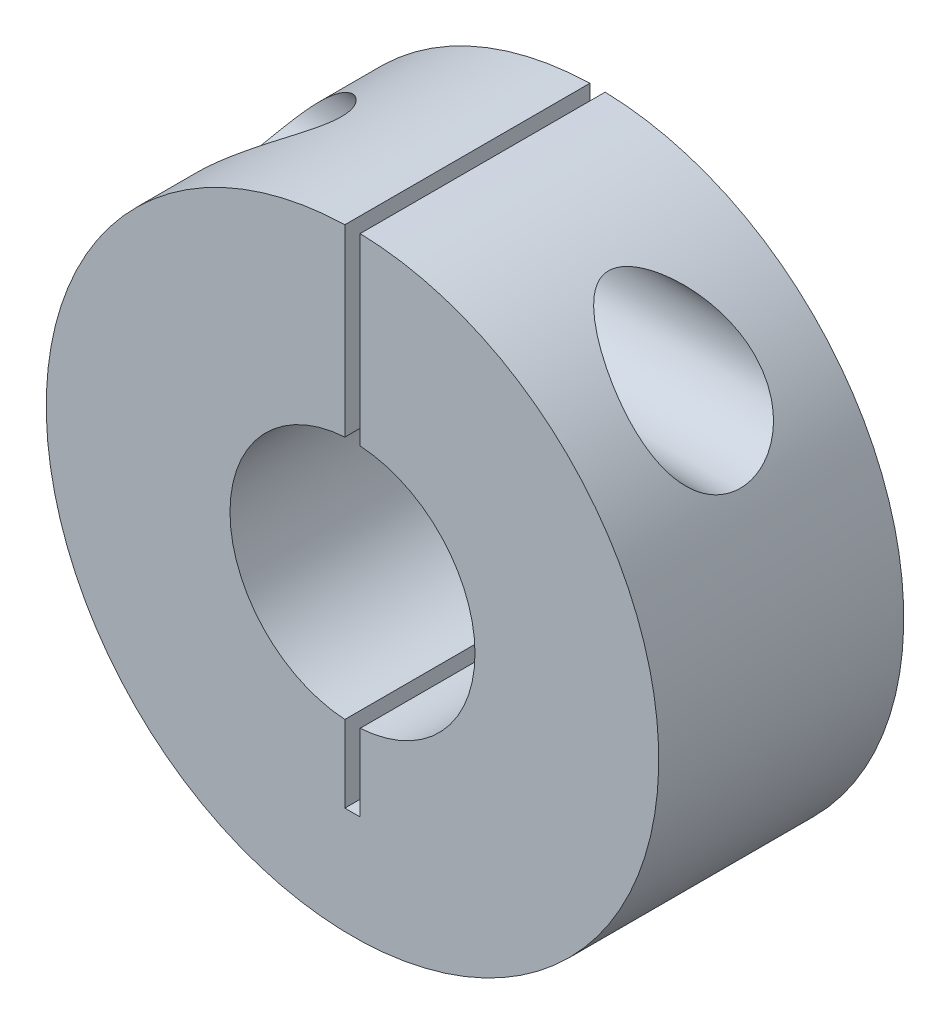
ISO-10303-21;
HEADER;
FILE_DESCRIPTION(('STEP AP214'),'2;1');
FILE_NAME('part.step','',(''),(''),'','','');
FILE_SCHEMA(('AUTOMOTIVE_DESIGN { 1 0 10303 214 1 1 1 1 }'));
ENDSEC;
DATA;
#1=APPLICATION_CONTEXT('core data for automotive mechanical design processes');
#2=APPLICATION_PROTOCOL_DEFINITION('international standard','automotive_design',2000,#1);
#3=PRODUCT_CONTEXT('',#1,'mechanical');
#4=PRODUCT('Part','Part','',(#3));
#5=PRODUCT_RELATED_PRODUCT_CATEGORY('part','',(#4));
#6=PRODUCT_DEFINITION_FORMATION('','',#4);
#7=PRODUCT_DEFINITION_CONTEXT('part definition',#1,'design');
#8=PRODUCT_DEFINITION('design','',#6,#7);
#9=PRODUCT_DEFINITION_SHAPE('','',#8);
#10=(LENGTH_UNIT() NAMED_UNIT(*) SI_UNIT(.MILLI.,.METRE.));
#11=(NAMED_UNIT(*) PLANE_ANGLE_UNIT() SI_UNIT($,.RADIAN.));
#12=(NAMED_UNIT(*) SI_UNIT($,.STERADIAN.) SOLID_ANGLE_UNIT());
#13=UNCERTAINTY_MEASURE_WITH_UNIT(LENGTH_MEASURE(1.E-05),#10,'distance_accuracy_value','');
#14=(GEOMETRIC_REPRESENTATION_CONTEXT(3) GLOBAL_UNCERTAINTY_ASSIGNED_CONTEXT((#13)) GLOBAL_UNIT_ASSIGNED_CONTEXT((#10,
#11,#12)) REPRESENTATION_CONTEXT('',''));
#15=CARTESIAN_POINT('',(0.,0.,0.));
#16=DIRECTION('',(0.,0.,1.));
#17=DIRECTION('',(1.,0.,0.));
#18=AXIS2_PLACEMENT_3D('',#15,#16,#17);
#19=CARTESIAN_POINT('',(0.,0.,8.));
#20=DIRECTION('',(0.,0.,-1.));
#21=DIRECTION('',(-1.,0.,0.));
#22=AXIS2_PLACEMENT_3D('',#19,#20,#21);
#23=CYLINDRICAL_SURFACE('',#22,4.);
#24=DIRECTION('',(0.,0.,-1.));
#25=VECTOR('',#24,1.);
#26=CARTESIAN_POINT('',(0.25,-3.99217985566783,8.));
#27=LINE('',#26,#25);
#28=CARTESIAN_POINT('',(0.25,-3.99217985566783,8.));
#29=VERTEX_POINT('',#28);
#30=CARTESIAN_POINT('',(0.25,-3.99217985566783,0.));
#31=VERTEX_POINT('',#30);
#32=EDGE_CURVE('E11',#29,#31,#27,.T.);
#33=ORIENTED_EDGE('',*,*,#32,.F.);
#34=CARTESIAN_POINT('',(0.,0.,8.));
#35=DIRECTION('',(0.,0.,1.));
#36=DIRECTION('',(1.,0.,0.));
#37=AXIS2_PLACEMENT_3D('',#34,#35,#36);
#38=CIRCLE('',#37,4.);
#39=CARTESIAN_POINT('',(0.25,3.99217985566783,8.));
#40=VERTEX_POINT('',#39);
#41=EDGE_CURVE('E163',#29,#40,#38,.T.);
#42=ORIENTED_EDGE('',*,*,#41,.T.);
#43=DIRECTION('',(0.,0.,-1.));
#44=VECTOR('',#43,1.);
#45=CARTESIAN_POINT('',(0.25,3.99217985566783,8.));
#46=LINE('',#45,#44);
#47=CARTESIAN_POINT('',(0.25,3.99217985566783,0.));
#48=VERTEX_POINT('',#47);
#49=EDGE_CURVE('E54',#48,#40,#46,.F.);
#50=ORIENTED_EDGE('',*,*,#49,.F.);
#51=CARTESIAN_POINT('',(0.,0.,0.));
#52=DIRECTION('',(0.,0.,1.));
#53=DIRECTION('',(1.,0.,0.));
#54=AXIS2_PLACEMENT_3D('',#51,#52,#53);
#55=CIRCLE('',#54,4.);
#56=EDGE_CURVE('E162',#31,#48,#55,.T.);
#57=ORIENTED_EDGE('',*,*,#56,.F.);
#58=EDGE_LOOP('',(#33,#42,#50,#57));
#59=FACE_BOUND('',#58,.T.);
#60=ADVANCED_FACE('F43',(#59),#23,.F.);
#61=CARTESIAN_POINT('',(0.,0.,8.));
#62=DIRECTION('',(0.,0.,1.));
#63=DIRECTION('',(1.,0.,0.));
#64=AXIS2_PLACEMENT_3D('',#61,#62,#63);
#65=PLANE('',#64);
#66=DIRECTION('',(0.,1.,0.));
#67=VECTOR('',#66,1.);
#68=CARTESIAN_POINT('',(0.25,-6.5,8.));
#69=LINE('',#68,#67);
#70=CARTESIAN_POINT('',(0.25,9.9968745115661,8.));
#71=VERTEX_POINT('',#70);
#72=EDGE_CURVE('E145',#40,#71,#69,.T.);
#73=ORIENTED_EDGE('',*,*,#72,.F.);
#74=ORIENTED_EDGE('',*,*,#41,.F.);
#75=CARTESIAN_POINT('',(0.25,-6.5,8.));
#76=VERTEX_POINT('',#75);
#77=EDGE_CURVE('E142',#76,#29,#69,.T.);
#78=ORIENTED_EDGE('',*,*,#77,.F.);
#79=DIRECTION('',(1.,0.,0.));
#80=VECTOR('',#79,1.);
#81=CARTESIAN_POINT('',(-0.25,-6.5,8.));
#82=LINE('',#81,#80);
#83=CARTESIAN_POINT('',(-0.25,-6.5,8.));
#84=VERTEX_POINT('',#83);
#85=EDGE_CURVE('E149',#84,#76,#82,.T.);
#86=ORIENTED_EDGE('',*,*,#85,.F.);
#87=DIRECTION('',(0.,-1.,0.));
#88=VECTOR('',#87,1.);
#89=CARTESIAN_POINT('',(-0.25,-6.5,8.));
#90=LINE('',#89,#88);
#91=CARTESIAN_POINT('',(-0.25,-3.99217985566783,8.));
#92=VERTEX_POINT('',#91);
#93=EDGE_CURVE('E112',#92,#84,#90,.T.);
#94=ORIENTED_EDGE('',*,*,#93,.F.);
#95=CARTESIAN_POINT('',(-0.25,3.99217985566783,8.));
#96=VERTEX_POINT('',#95);
#97=EDGE_CURVE('E167',#96,#92,#38,.T.);
#98=ORIENTED_EDGE('',*,*,#97,.F.);
#99=CARTESIAN_POINT('',(-0.25,9.9968745115661,8.));
#100=VERTEX_POINT('',#99);
#101=EDGE_CURVE('E148',#100,#96,#90,.T.);
#102=ORIENTED_EDGE('',*,*,#101,.F.);
#103=CARTESIAN_POINT('',(0.,0.,8.));
#104=DIRECTION('',(0.,0.,1.));
#105=DIRECTION('',(1.,0.,0.));
#106=AXIS2_PLACEMENT_3D('',#103,#104,#105);
#107=CIRCLE('',#106,10.);
#108=EDGE_CURVE('E170',#100,#71,#107,.T.);
#109=ORIENTED_EDGE('',*,*,#108,.T.);
#110=EDGE_LOOP('',(#73,#74,#78,#86,#94,#98,#102,#109));
#111=FACE_BOUND('',#110,.T.);
#112=ADVANCED_FACE('F191',(#111),#65,.T.);
#113=CARTESIAN_POINT('',(0.,0.,0.));
#114=DIRECTION('',(0.,0.,1.));
#115=DIRECTION('',(1.,0.,0.));
#116=AXIS2_PLACEMENT_3D('',#113,#114,#115);
#117=PLANE('',#116);
#118=ORIENTED_EDGE('',*,*,#56,.T.);
#119=DIRECTION('',(0.,1.,0.));
#120=VECTOR('',#119,1.);
#121=CARTESIAN_POINT('',(0.25,-6.5,0.));
#122=LINE('',#121,#120);
#123=CARTESIAN_POINT('',(0.25,9.9968745115661,0.));
#124=VERTEX_POINT('',#123);
#125=EDGE_CURVE('E69',#48,#124,#122,.T.);
#126=ORIENTED_EDGE('',*,*,#125,.T.);
#127=CARTESIAN_POINT('',(0.,0.,0.));
#128=DIRECTION('',(0.,0.,1.));
#129=DIRECTION('',(1.,0.,0.));
#130=AXIS2_PLACEMENT_3D('',#127,#128,#129);
#131=CIRCLE('',#130,10.);
#132=CARTESIAN_POINT('',(-0.25,9.9968745115661,0.));
#133=VERTEX_POINT('',#132);
#134=EDGE_CURVE('E175',#133,#124,#131,.T.);
#135=ORIENTED_EDGE('',*,*,#134,.F.);
#136=DIRECTION('',(0.,-1.,0.));
#137=VECTOR('',#136,1.);
#138=CARTESIAN_POINT('',(-0.25,-6.5,0.));
#139=LINE('',#138,#137);
#140=CARTESIAN_POINT('',(-0.25,3.99217985566783,0.));
#141=VERTEX_POINT('',#140);
#142=EDGE_CURVE('E126',#133,#141,#139,.T.);
#143=ORIENTED_EDGE('',*,*,#142,.T.);
#144=CARTESIAN_POINT('',(-0.25,-3.99217985566783,0.));
#145=VERTEX_POINT('',#144);
#146=EDGE_CURVE('E133',#141,#145,#55,.T.);
#147=ORIENTED_EDGE('',*,*,#146,.T.);
#148=CARTESIAN_POINT('',(-0.25,-6.5,0.));
#149=VERTEX_POINT('',#148);
#150=EDGE_CURVE('E61',#145,#149,#139,.T.);
#151=ORIENTED_EDGE('',*,*,#150,.T.);
#152=DIRECTION('',(1.,0.,0.));
#153=VECTOR('',#152,1.);
#154=CARTESIAN_POINT('',(-0.25,-6.5,0.));
#155=LINE('',#154,#153);
#156=CARTESIAN_POINT('',(0.25,-6.5,0.));
#157=VERTEX_POINT('',#156);
#158=EDGE_CURVE('E118',#149,#157,#155,.T.);
#159=ORIENTED_EDGE('',*,*,#158,.T.);
#160=EDGE_CURVE('E135',#157,#31,#122,.T.);
#161=ORIENTED_EDGE('',*,*,#160,.T.);
#162=EDGE_LOOP('',(#118,#126,#135,#143,#147,#151,#159,#161));
#163=FACE_BOUND('',#162,.T.);
#164=ADVANCED_FACE('F130',(#163),#117,.F.);
#165=CARTESIAN_POINT('',(0.,0.,8.));
#166=DIRECTION('',(0.,0.,-1.));
#167=DIRECTION('',(-1.,0.,0.));
#168=AXIS2_PLACEMENT_3D('',#165,#166,#167);
#169=CYLINDRICAL_SURFACE('',#168,10.);
#170=CARTESIAN_POINT('',(-7.14142842854285,7.,2.));
#171=CARTESIAN_POINT('',(-7.06150419132655,7.08153610290728,1.99999975804951));
#172=CARTESIAN_POINT('',(-6.98015817702816,7.16172627364786,2.00498268316458));
#173=CARTESIAN_POINT('',(-6.81529120187934,7.31879776650672,2.02398512631954));
#174=CARTESIAN_POINT('',(-6.73176850561924,7.39567631023958,2.03801208043003));
#175=CARTESIAN_POINT('',(-6.56276492174004,7.54605656176687,2.07442578685816));
#176=CARTESIAN_POINT('',(-6.47727639806478,7.61953970879222,2.09685350040483));
#177=CARTESIAN_POINT('',(-6.30533625106101,7.76242420553829,2.14945821479109));
#178=CARTESIAN_POINT('',(-6.21888489277761,7.83182664708496,2.17963313110114));
#179=CARTESIAN_POINT('',(-6.04332931835712,7.96811356004267,2.24822198236587));
#180=CARTESIAN_POINT('',(-5.95421414541275,8.03488706854973,2.28682818159249));
#181=CARTESIAN_POINT('',(-5.77622929176273,8.1637763568549,2.37163337830141));
#182=CARTESIAN_POINT('',(-5.68735960305037,8.22589229033411,2.41783212509973));
#183=CARTESIAN_POINT('',(-5.51109030435886,8.34500750049791,2.51777978777239));
#184=CARTESIAN_POINT('',(-5.42368609317854,8.40202713672006,2.57149623792353));
#185=CARTESIAN_POINT('',(-5.25120766828404,8.5108863683584,2.68716560373273));
#186=CARTESIAN_POINT('',(-5.16613136286597,8.56273073283767,2.74911081147179));
#187=CARTESIAN_POINT('',(-5.02180027164385,8.64792505235648,2.8650647168862));
#188=CARTESIAN_POINT('',(-4.96159606312077,8.68257288742373,2.91693228349551));
#189=CARTESIAN_POINT('',(-4.8446370130887,8.74837065674288,3.02670529329354));
#190=CARTESIAN_POINT('',(-4.78788663801367,8.77951610409135,3.08461830229247));
#191=CARTESIAN_POINT('',(-4.67941199682533,8.83781220585769,3.20806315946386));
#192=CARTESIAN_POINT('',(-4.62774255952665,8.86492062809146,3.27366423978796));
#193=CARTESIAN_POINT('',(-4.53368247414242,8.91338894984784,3.41318042878339));
#194=CARTESIAN_POINT('',(-4.49126329851238,8.93476657114521,3.48706888049577));
#195=CARTESIAN_POINT('',(-4.4348190466584,8.96286626061706,3.61325470615379));
#196=CARTESIAN_POINT('',(-4.41615178739677,8.97206118798676,3.66289635338202));
#197=CARTESIAN_POINT('',(-4.38609497460502,8.98679322870347,3.76485218340029));
#198=CARTESIAN_POINT('',(-4.37469440306313,8.99233588019519,3.8171621896243));
#199=CARTESIAN_POINT('',(-4.36043936716119,8.99925766004896,3.92364469369938));
#200=CARTESIAN_POINT('',(-4.35764860780202,9.00060575300803,3.97782808943273));
#201=CARTESIAN_POINT('',(-4.36119531051155,8.99888759338966,4.08583487711769));
#202=CARTESIAN_POINT('',(-4.36753619849094,8.99581968406541,4.13965812634149));
#203=CARTESIAN_POINT('',(-4.3876283166991,8.98603496425114,4.24093389575928));
#204=CARTESIAN_POINT('',(-4.40073952846805,8.97963294812846,4.28854981535349));
#205=CARTESIAN_POINT('',(-4.43272350435098,8.96388763313435,4.38126017836932));
#206=CARTESIAN_POINT('',(-4.45159888381811,8.95454299906033,4.42635346619558));
#207=CARTESIAN_POINT('',(-4.51003630704254,8.9253171571314,4.54723816488964));
#208=CARTESIAN_POINT('',(-4.55436772656936,8.90284858158005,4.6200792069848));
#209=CARTESIAN_POINT('',(-4.65168614527961,8.85239211746932,4.75766079441994));
#210=CARTESIAN_POINT('',(-4.70470556067464,8.82438347377683,4.82236933418668));
#211=CARTESIAN_POINT('',(-4.81306385527899,8.76572954070735,4.94146270607763));
#212=CARTESIAN_POINT('',(-4.86812505626936,8.73530677047467,4.99621541930925));
#213=CARTESIAN_POINT('',(-4.98139179945346,8.67121550481551,5.10035463462927));
#214=CARTESIAN_POINT('',(-5.03960005594433,8.63754418727265,5.14973639012494));
#215=CARTESIAN_POINT('',(-5.15816603387263,8.56726812792062,5.24383375213931));
#216=CARTESIAN_POINT('',(-5.21852742965481,8.53065822388147,5.28854081481609));
#217=CARTESIAN_POINT('',(-5.34060522586058,8.45476839923875,5.37364397968903));
#218=CARTESIAN_POINT('',(-5.40232200023977,8.41548773533128,5.41403887365227));
#219=CARTESIAN_POINT('',(-5.56035995991305,8.31236976445263,5.51166101684421));
#220=CARTESIAN_POINT('',(-5.65726705424301,8.24678406114885,5.56611187298563));
#221=CARTESIAN_POINT('',(-5.85179336823416,8.10991267816718,5.66591233563136));
#222=CARTESIAN_POINT('',(-5.94941294047159,8.03862397400575,5.71125706752026));
#223=CARTESIAN_POINT('',(-6.14431234800201,7.89065123444242,5.79272597705337));
#224=CARTESIAN_POINT('',(-6.24159237166759,7.81397096731419,5.82885651455203));
#225=CARTESIAN_POINT('',(-6.43499316269179,7.65548859586189,5.89145107984339));
#226=CARTESIAN_POINT('',(-6.5311144065998,7.57368868909193,5.91791922223685));
#227=CARTESIAN_POINT('',(-6.7737647448864,7.35899341753901,5.97211848500364));
#228=CARTESIAN_POINT('',(-6.91901574967508,7.22268784999144,5.9925750583552));
#229=CARTESIAN_POINT('',(-7.20154914516818,6.94098567273588,6.00407493609927));
#230=CARTESIAN_POINT('',(-7.3388455405525,6.79560603823035,5.99517163757606));
#231=CARTESIAN_POINT('',(-7.56926542003292,6.53670533790726,5.94888134117593));
#232=CARTESIAN_POINT('',(-7.66495213196123,6.42413582557378,5.91903263629335));
#233=CARTESIAN_POINT('',(-7.84741302196834,6.19990978576708,5.83686267892829));
#234=CARTESIAN_POINT('',(-7.93419813619704,6.0882522969623,5.784569420784));
#235=CARTESIAN_POINT('',(-8.08151590028298,5.89079168772017,5.66742615565303));
#236=CARTESIAN_POINT('',(-8.14394407022271,5.80400285206684,5.60663862879229));
#237=CARTESIAN_POINT('',(-8.25982145114576,5.63787097737262,5.46842080285883));
#238=CARTESIAN_POINT('',(-8.31327302796717,5.5585259789021,5.39099490123728));
#239=CARTESIAN_POINT('',(-8.41016815263322,5.41081838908641,5.21958492123179));
#240=CARTESIAN_POINT('',(-8.45353562929796,5.34254038232211,5.1254838595032));
#241=CARTESIAN_POINT('',(-8.52852767677894,5.22200058338746,4.9233258603293));
#242=CARTESIAN_POINT('',(-8.56016034520288,5.16972775120806,4.81527861610843));
#243=CARTESIAN_POINT('',(-8.60754978651498,5.09037784493339,4.60367489313175));
#244=CARTESIAN_POINT('',(-8.62483257565722,5.06091367541551,4.50135060060269));
#245=CARTESIAN_POINT('',(-8.64953084257331,5.01858871945195,4.29218487406776));
#246=CARTESIAN_POINT('',(-8.65695168275385,5.00571890998363,4.18534592752913));
#247=CARTESIAN_POINT('',(-8.6616048279559,4.99766063046903,3.97925719313603));
#248=CARTESIAN_POINT('',(-8.65959379745085,5.00115898101862,3.88007267391502));
#249=CARTESIAN_POINT('',(-8.6471276084134,5.0226823094473,3.68385173774141));
#250=CARTESIAN_POINT('',(-8.63667407812205,5.04070448622448,3.58681491028699));
#251=CARTESIAN_POINT('',(-8.60765547532383,5.09009501823572,3.39864649680164));
#252=CARTESIAN_POINT('',(-8.5891797357099,5.12131629417747,3.30746222038993));
#253=CARTESIAN_POINT('',(-8.5444479790056,5.19560191583813,3.13211843547365));
#254=CARTESIAN_POINT('',(-8.51819093170275,5.23866782968307,3.04795985903446));
#255=CARTESIAN_POINT('',(-8.45700090992282,5.33691097969843,2.8848301751364));
#256=CARTESIAN_POINT('',(-8.42173101010809,5.39254559828973,2.80626227660411));
#257=CARTESIAN_POINT('',(-8.3438626960354,5.51226378542525,2.66000627455024));
#258=CARTESIAN_POINT('',(-8.30126288576849,5.57634896286592,2.59232024828084));
#259=CARTESIAN_POINT('',(-8.20475486741886,5.71751856346557,2.46201586612969));
#260=CARTESIAN_POINT('',(-8.15013297310083,5.7952619524659,2.40064408168173));
#261=CARTESIAN_POINT('',(-8.03398802590271,5.95523708242969,2.29182731651601));
#262=CARTESIAN_POINT('',(-7.97245755167807,6.03747360038964,2.24439751425434));
#263=CARTESIAN_POINT('',(-7.81441286681865,6.24165164443768,2.1444608150802));
#264=CARTESIAN_POINT('',(-7.71466409777141,6.36472655741324,2.09936229002446));
#265=CARTESIAN_POINT('',(-7.50604712893444,6.60947668378607,2.03440685744847));
#266=CARTESIAN_POINT('',(-7.39717953021221,6.73115198883813,2.01454828763041));
#267=CARTESIAN_POINT('',(-7.23776093900918,6.90069806898964,2.00182977452207));
#268=CARTESIAN_POINT('',(-7.1898556738831,6.95059610204483,2.00000014660128));
#269=CARTESIAN_POINT('',(-7.14142842854285,7.,2.));
#270=B_SPLINE_CURVE_WITH_KNOTS('',3,(#170,#171,#172,#173,#174,#175,#176,#177,#178,#179,#180,
#181,#182,#183,#184,#185,#186,#187,#188,#189,#190,#191,#192,#193,#194,#195,#196,#197,#198,#199,
#200,#201,#202,#203,#204,#205,#206,#207,#208,#209,#210,#211,#212,#213,#214,#215,#216,#217,#218,
#219,#220,#221,#222,#223,#224,#225,#226,#227,#228,#229,#230,#231,#232,#233,#234,#235,#236,#237,
#238,#239,#240,#241,#242,#243,#244,#245,#246,#247,#248,#249,#250,#251,#252,#253,#254,#255,#256,
#257,#258,#259,#260,#261,#262,#263,#264,#265,#266,#267,#268,#269),.UNSPECIFIED.,.T.,.F.,(4,2,2,
2,2,2,2,2,2,2,2,2,2,2,2,2,2,2,2,2,2,2,2,2,2,2,2,2,2,2,2,2,2,2,2,2,2,2,2,2,2,2,2,2,2,2,2,2,2,4),
(0.,0.342483522948836,0.68524899821193,1.0297079906693,1.37407439695924,1.72731428620271,
2.08054251482769,2.43228985184327,2.78370999857377,3.0435134014953,3.30364593499357,
3.56633296360577,3.82819804186722,3.98912519286543,4.14980775625861,4.31167641150877,
4.47360581067766,4.62245389777647,4.77136962172932,5.03437951300253,5.29839406408455,
5.54822340992746,5.79827177897708,6.04876944923153,6.2993371235862,6.68601833598391,
7.07290599482281,7.45952588748314,7.84598095069191,8.44446630608412,9.04186379108655,
9.49243763783071,9.94245112464532,10.30992278911,10.6772974515747,11.0473595378509,
11.4171657855719,11.7390544132989,12.0607679432906,12.3571344719786,12.6534438563424,
12.9465350130873,13.2396649912205,13.545970922412,13.8523352554204,14.1903600626219,
14.5287515215725,15.020213325693,15.5116427605716,15.7191584550405),.UNSPECIFIED.);
#271=CARTESIAN_POINT('',(-7.14142842854285,7.,2.));
#272=VERTEX_POINT('',#271);
#273=EDGE_CURVE('E196',#272,#272,#270,.T.);
#274=ORIENTED_EDGE('',*,*,#273,.T.);
#275=EDGE_LOOP('',(#274));
#276=FACE_BOUND('',#275,.T.);
#277=CARTESIAN_POINT('',(7.14142842854285,7.,2.));
#278=CARTESIAN_POINT('',(7.26002695864612,6.87900011333282,1.99999819494068));
#279=CARTESIAN_POINT('',(7.37561253519922,6.75489466010878,2.01095180466549));
#280=CARTESIAN_POINT('',(7.5979722375126,6.50375381670853,2.05834875664599));
#281=CARTESIAN_POINT('',(7.70476129187983,6.37672387903474,2.09474787560633));
#282=CARTESIAN_POINT('',(7.88428806256045,6.15255245506921,2.185323526947));
#283=CARTESIAN_POINT('',(7.95934561499087,6.05498951970519,2.23381983060137));
#284=CARTESIAN_POINT('',(8.10061447129122,5.86464478839419,2.34973778047067));
#285=CARTESIAN_POINT('',(8.16682722137119,5.7718622123404,2.41715632711303));
#286=CARTESIAN_POINT('',(8.28915112309792,5.59478979850747,2.5719502376893));
#287=CARTESIAN_POINT('',(8.34516676975658,5.5105832156357,2.65949846893973));
#288=CARTESIAN_POINT('',(8.44457818588117,5.35700456886801,2.85293368112891));
#289=CARTESIAN_POINT('',(8.48798643102841,5.28761785805657,2.95880236628377));
#290=CARTESIAN_POINT('',(8.55546982356056,5.17759562916049,3.16886515407858));
#291=CARTESIAN_POINT('',(8.58144732932513,5.134235095276,3.27102484926662));
#292=CARTESIAN_POINT('',(8.62264517997131,5.06474528988793,3.48308192468494));
#293=CARTESIAN_POINT('',(8.63787332100926,5.03860353110245,3.59297363339985));
#294=CARTESIAN_POINT('',(8.6561867754193,5.00706677061521,3.80417745124687));
#295=CARTESIAN_POINT('',(8.66042476434368,4.99970385169262,3.90510145103875));
#296=CARTESIAN_POINT('',(8.6600729666551,5.0003140675131,4.10687186797668));
#297=CARTESIAN_POINT('',(8.65548604655078,5.0082822224139,4.20771829967416));
#298=CARTESIAN_POINT('',(8.63786169319067,5.03861406716411,4.40300383653981));
#299=CARTESIAN_POINT('',(8.62510771932499,5.06049471351105,4.49754457294032));
#300=CARTESIAN_POINT('',(8.59163062863199,5.11712390214974,4.68118378964696));
#301=CARTESIAN_POINT('',(8.57090736758809,5.15187267730977,4.77028217143145));
#302=CARTESIAN_POINT('',(8.52121178253737,5.23366841474499,4.94310414767345));
#303=CARTESIAN_POINT('',(8.49204237094069,5.28100669535114,5.02663245665472));
#304=CARTESIAN_POINT('',(8.42621836207289,5.38541040606455,5.18407445818329));
#305=CARTESIAN_POINT('',(8.38956187787674,5.44247828766831,5.25798571929751));
#306=CARTESIAN_POINT('',(8.30612989519939,5.56905699085809,5.40079877894479));
#307=CARTESIAN_POINT('',(8.25877099681864,5.63920449835329,5.46879232601256));
#308=CARTESIAN_POINT('',(8.15700714875018,5.78542800714689,5.59184196809371));
#309=CARTESIAN_POINT('',(8.10259928161257,5.8615064579416,5.64689267958185));
#310=CARTESIAN_POINT('',(7.97935554385704,6.02844397952251,5.75132291639075));
#311=CARTESIAN_POINT('',(7.90957226058623,6.11984285426081,5.79871132679522));
#312=CARTESIAN_POINT('',(7.76344732098414,6.30418456128909,5.87774218639983));
#313=CARTESIAN_POINT('',(7.68710107806237,6.39712843612059,5.9093735169661));
#314=CARTESIAN_POINT('',(7.5472850739558,6.5610444154574,5.9526306130399));
#315=CARTESIAN_POINT('',(7.48487008599774,6.63217415884524,5.96717882792549));
#316=CARTESIAN_POINT('',(7.35743242076337,6.77327459583783,5.9883879857883));
#317=CARTESIAN_POINT('',(7.29240873851306,6.84324482779572,5.99504585833029));
#318=CARTESIAN_POINT('',(7.09388145908855,7.0507717824502,6.00415289993249));
#319=CARTESIAN_POINT('',(6.95706960228679,7.1857709032732,5.99569344229408));
#320=CARTESIAN_POINT('',(6.7269045412482,7.40028881452322,5.96140593686447));
#321=CARTESIAN_POINT('',(6.63503845624203,7.48273438375163,5.94266558768509));
#322=CARTESIAN_POINT('',(6.44972604718536,7.64303627076199,5.89564659814738));
#323=CARTESIAN_POINT('',(6.35627978165408,7.72089275801567,5.86736831027835));
#324=CARTESIAN_POINT('',(6.16843603749639,7.87178160268193,5.80188071426872));
#325=CARTESIAN_POINT('',(6.07403745112817,7.94480734943646,5.76465947785704));
#326=CARTESIAN_POINT('',(5.88519213924394,8.08568944939843,5.68165489440639));
#327=CARTESIAN_POINT('',(5.79074544398774,8.15354768463099,5.63587468576581));
#328=CARTESIAN_POINT('',(5.62766342125549,8.26658793021246,5.54899909729674));
#329=CARTESIAN_POINT('',(5.55882657986996,8.31301051737488,5.50988197961415));
#330=CARTESIAN_POINT('',(5.42210292257825,8.40282590401386,5.42682238655372));
#331=CARTESIAN_POINT('',(5.35421590588661,8.44621935180701,5.38288094892069));
#332=CARTESIAN_POINT('',(5.22023771739414,8.52967327971891,5.28995706931397));
#333=CARTESIAN_POINT('',(5.15414158889628,8.56974376865793,5.24099083921736));
#334=CARTESIAN_POINT('',(5.02449666535525,8.64639178219689,5.13734305559715));
#335=CARTESIAN_POINT('',(4.96094601576516,8.68297187765847,5.08266577173014));
#336=CARTESIAN_POINT('',(4.84390862252967,8.74874846436736,4.97241084339917));
#337=CARTESIAN_POINT('',(4.7900482396442,8.77831740109159,4.91745742272349));
#338=CARTESIAN_POINT('',(4.68724537159026,8.83363609110219,4.80120251395949));
#339=CARTESIAN_POINT('',(4.63830442977179,8.85938464703954,4.7398990458764));
#340=CARTESIAN_POINT('',(4.55483419535849,8.9025481197848,4.61949937292795));
#341=CARTESIAN_POINT('',(4.51924398531853,8.9206312258197,4.56139418194015));
#342=CARTESIAN_POINT('',(4.45657722859158,8.95210313541098,4.4395697045384));
#343=CARTESIAN_POINT('',(4.4294788801289,8.96550397045603,4.37586534139815));
#344=CARTESIAN_POINT('',(4.39293796715368,8.9834513311206,4.26137522481838));
#345=CARTESIAN_POINT('',(4.38070830471821,8.98940919634012,4.21171410751838));
#346=CARTESIAN_POINT('',(4.3639306536489,8.99756635482607,4.11081647153526));
#347=CARTESIAN_POINT('',(4.35937374462873,8.99977001279021,4.05958185290805));
#348=CARTESIAN_POINT('',(4.35849441345406,9.0001959532983,3.95691902649152));
#349=CARTESIAN_POINT('',(4.36218862987028,8.99841019108964,3.90549063668775));
#350=CARTESIAN_POINT('',(4.37737517316677,8.99103183815163,3.80407466728567));
#351=CARTESIAN_POINT('',(4.38887569813329,8.98543524531676,3.75408866004986));
#352=CARTESIAN_POINT('',(4.42316379701011,8.96861678240202,3.64116500819245));
#353=CARTESIAN_POINT('',(4.44837668707741,8.95617253688308,3.5791588569695));
#354=CARTESIAN_POINT('',(4.50704471020965,8.92679219391628,3.46032825093475));
#355=CARTESIAN_POINT('',(4.54052057843018,8.909844787905,3.40351733228399));
#356=CARTESIAN_POINT('',(4.60805452306139,8.8750815411283,3.30249764645509));
#357=CARTESIAN_POINT('',(4.6413854983561,8.85771350767758,3.25763462630353));
#358=CARTESIAN_POINT('',(4.71110795318222,8.82082902993852,3.17127505214319));
#359=CARTESIAN_POINT('',(4.74750174615674,8.80131095815768,3.12978109022115));
#360=CARTESIAN_POINT('',(4.86012101197008,8.73993680996916,3.00967484421704));
#361=CARTESIAN_POINT('',(4.93967317504293,8.69531715415563,2.93559286518499));
#362=CARTESIAN_POINT('',(5.09889716053891,8.60286561684188,2.80122020250302));
#363=CARTESIAN_POINT('',(5.17831321597163,8.55535317483102,2.74038977682562));
#364=CARTESIAN_POINT('',(5.3396734985062,8.45558317422787,2.62631147460662));
#365=CARTESIAN_POINT('',(5.42161967884601,8.403321885866,2.5730696439687));
#366=CARTESIAN_POINT('',(5.58694245297548,8.29432944123469,2.47351245125978));
#367=CARTESIAN_POINT('',(5.67032109882807,8.23759136560376,2.427208145215));
#368=CARTESIAN_POINT('',(5.83759331151306,8.11991168123111,2.34135573624407));
#369=CARTESIAN_POINT('',(5.92148692868216,8.05896965540916,2.30180830503481));
#370=CARTESIAN_POINT('',(6.10257909103454,7.92296126725668,2.22370108441279));
#371=CARTESIAN_POINT('',(6.19975961780208,7.8471947817034,2.18631085550152));
#372=CARTESIAN_POINT('',(6.39316509091429,7.69044491309626,2.12103912453468));
#373=CARTESIAN_POINT('',(6.48938972242198,7.60945987296459,2.09316066067));
#374=CARTESIAN_POINT('',(6.67986270898246,7.44280874409532,2.04772923431901));
#375=CARTESIAN_POINT('',(6.77411495059798,7.35715336017376,2.03015366121033));
#376=CARTESIAN_POINT('',(6.95996322333542,7.18159131413185,2.00629311201135));
#377=CARTESIAN_POINT('',(7.05156081427827,7.09168723365792,2.00000136777728));
#378=CARTESIAN_POINT('',(7.14142842854285,7.,2.));
#379=B_SPLINE_CURVE_WITH_KNOTS('',3,(#277,#278,#279,#280,#281,#282,#283,#284,#285,#286,#287,
#288,#289,#290,#291,#292,#293,#294,#295,#296,#297,#298,#299,#300,#301,#302,#303,#304,#305,#306,
#307,#308,#309,#310,#311,#312,#313,#314,#315,#316,#317,#318,#319,#320,#321,#322,#323,#324,#325,
#326,#327,#328,#329,#330,#331,#332,#333,#334,#335,#336,#337,#338,#339,#340,#341,#342,#343,#344,
#345,#346,#347,#348,#349,#350,#351,#352,#353,#354,#355,#356,#357,#358,#359,#360,#361,#362,#363,
#364,#365,#366,#367,#368,#369,#370,#371,#372,#373,#374,#375,#376,#377,#378),.UNSPECIFIED.,.T.,
.F.,(4,2,2,2,2,2,2,2,2,2,2,2,2,2,2,2,2,2,2,2,2,2,2,2,2,2,2,2,2,2,2,2,2,2,2,2,2,2,2,2,2,2,2,2,2,
2,2,2,2,2,4),(0.,0.507962855170402,1.01504507856683,1.41045699197029,1.80580417238538,
2.20468241921539,2.6031645997989,2.94316666378213,3.28292188151974,3.58525667819819,
3.88749328700992,4.17976999268996,4.47205198781802,4.77179578124907,5.07161521085141,
5.39602851716538,5.72057652422033,6.09235404632369,6.46439353469776,6.75123910922489,
7.03819626976744,7.61279853043497,7.98697101421785,8.36112967139204,8.73579018624894,
9.11031358932032,9.38549601445651,9.66061936148533,9.93488141492081,10.2089398745758,
10.4558853422701,10.7029080426215,10.9137628157122,11.1240717247893,11.2779058571575,
11.4315610172909,11.5855263060229,11.7396535378279,11.9427549910821,12.1463713839448,
12.3216977247655,12.4971577045874,12.8486674948282,13.180508685277,13.5126127962821,
13.8452406624637,14.1779015767514,14.5637668629595,14.9497552848072,15.3348934179386,
15.7198004643366),.UNSPECIFIED.);
#380=CARTESIAN_POINT('',(7.14142842854285,7.,2.));
#381=VERTEX_POINT('',#380);
#382=EDGE_CURVE('E212',#381,#381,#379,.T.);
#383=ORIENTED_EDGE('',*,*,#382,.T.);
#384=EDGE_LOOP('',(#383));
#385=FACE_BOUND('',#384,.T.);
#386=ORIENTED_EDGE('',*,*,#134,.T.);
#387=DIRECTION('',(0.,0.,-1.));
#388=VECTOR('',#387,1.);
#389=CARTESIAN_POINT('',(0.25,9.9968745115661,8.));
#390=LINE('',#389,#388);
#391=EDGE_CURVE('E158',#124,#71,#390,.F.);
#392=ORIENTED_EDGE('',*,*,#391,.T.);
#393=ORIENTED_EDGE('',*,*,#108,.F.);
#394=DIRECTION('',(0.,0.,-1.));
#395=VECTOR('',#394,1.);
#396=CARTESIAN_POINT('',(-0.25,9.9968745115661,8.));
#397=LINE('',#396,#395);
#398=EDGE_CURVE('E153',#100,#133,#397,.T.);
#399=ORIENTED_EDGE('',*,*,#398,.T.);
#400=EDGE_LOOP('',(#386,#392,#393,#399));
#401=FACE_BOUND('',#400,.T.);
#402=ADVANCED_FACE('F45',(#276,#385,#401),#169,.T.);
#403=DIRECTION('',(0.,0.,-1.));
#404=VECTOR('',#403,1.);
#405=CARTESIAN_POINT('',(-0.25,3.99217985566783,8.));
#406=LINE('',#405,#404);
#407=EDGE_CURVE('E181',#96,#141,#406,.T.);
#408=ORIENTED_EDGE('',*,*,#407,.F.);
#409=ORIENTED_EDGE('',*,*,#97,.T.);
#410=DIRECTION('',(0.,0.,-1.));
#411=VECTOR('',#410,1.);
#412=CARTESIAN_POINT('',(-0.25,-3.99217985566783,8.));
#413=LINE('',#412,#411);
#414=EDGE_CURVE('E174',#145,#92,#413,.F.);
#415=ORIENTED_EDGE('',*,*,#414,.F.);
#416=ORIENTED_EDGE('',*,*,#146,.F.);
#417=EDGE_LOOP('',(#408,#409,#415,#416));
#418=FACE_BOUND('',#417,.T.);
#419=ADVANCED_FACE('F232',(#418),#23,.F.);
#420=CARTESIAN_POINT('',(0.25,-6.5,0.));
#421=DIRECTION('',(1.,0.,0.));
#422=DIRECTION('',(0.,0.,-1.));
#423=AXIS2_PLACEMENT_3D('',#420,#421,#422);
#424=PLANE('',#423);
#425=ORIENTED_EDGE('',*,*,#32,.T.);
#426=ORIENTED_EDGE('',*,*,#160,.F.);
#427=DIRECTION('',(0.,0.,1.));
#428=VECTOR('',#427,1.);
#429=CARTESIAN_POINT('',(0.25,-6.5,0.));
#430=LINE('',#429,#428);
#431=EDGE_CURVE('E117',#157,#76,#430,.T.);
#432=ORIENTED_EDGE('',*,*,#431,.T.);
#433=ORIENTED_EDGE('',*,*,#77,.T.);
#434=EDGE_LOOP('',(#425,#426,#432,#433));
#435=FACE_BOUND('',#434,.T.);
#436=ADVANCED_FACE('F199',(#435),#424,.F.);
#437=CARTESIAN_POINT('',(-0.25,-6.5,0.));
#438=DIRECTION('',(-1.,0.,0.));
#439=DIRECTION('',(0.,0.,1.));
#440=AXIS2_PLACEMENT_3D('',#437,#438,#439);
#441=PLANE('',#440);
#442=ORIENTED_EDGE('',*,*,#414,.T.);
#443=ORIENTED_EDGE('',*,*,#93,.T.);
#444=DIRECTION('',(0.,0.,1.));
#445=VECTOR('',#444,1.);
#446=CARTESIAN_POINT('',(-0.25,-6.5,0.));
#447=LINE('',#446,#445);
#448=EDGE_CURVE('E108',#149,#84,#447,.T.);
#449=ORIENTED_EDGE('',*,*,#448,.F.);
#450=ORIENTED_EDGE('',*,*,#150,.F.);
#451=EDGE_LOOP('',(#442,#443,#449,#450));
#452=FACE_BOUND('',#451,.T.);
#453=ADVANCED_FACE('F110',(#452),#441,.F.);
#454=CARTESIAN_POINT('',(-0.25,-6.5,0.));
#455=DIRECTION('',(0.,-1.,0.));
#456=DIRECTION('',(0.,0.,-1.));
#457=AXIS2_PLACEMENT_3D('',#454,#455,#456);
#458=PLANE('',#457);
#459=ORIENTED_EDGE('',*,*,#85,.T.);
#460=ORIENTED_EDGE('',*,*,#431,.F.);
#461=ORIENTED_EDGE('',*,*,#158,.F.);
#462=ORIENTED_EDGE('',*,*,#448,.T.);
#463=EDGE_LOOP('',(#459,#460,#461,#462));
#464=FACE_BOUND('',#463,.T.);
#465=ADVANCED_FACE('F121',(#464),#458,.F.);
#466=CARTESIAN_POINT('',(-0.25,7.,4.));
#467=DIRECTION('',(-1.,0.,0.));
#468=DIRECTION('',(0.,0.,1.));
#469=AXIS2_PLACEMENT_3D('',#466,#467,#468);
#470=CIRCLE('',#469,2.);
#471=CARTESIAN_POINT('',(-0.25,7.,6.));
#472=VERTEX_POINT('',#471);
#473=EDGE_CURVE('E215',#472,#472,#470,.T.);
#474=ORIENTED_EDGE('',*,*,#473,.T.);
#475=EDGE_LOOP('',(#474));
#476=FACE_BOUND('',#475,.T.);
#477=ORIENTED_EDGE('',*,*,#101,.T.);
#478=ORIENTED_EDGE('',*,*,#407,.T.);
#479=ORIENTED_EDGE('',*,*,#142,.F.);
#480=ORIENTED_EDGE('',*,*,#398,.F.);
#481=EDGE_LOOP('',(#477,#478,#479,#480));
#482=FACE_BOUND('',#481,.T.);
#483=ADVANCED_FACE('F204',(#476,#482),#441,.F.);
#484=CARTESIAN_POINT('',(0.25,7.,4.));
#485=DIRECTION('',(1.,0.,0.));
#486=DIRECTION('',(0.,0.,-1.));
#487=AXIS2_PLACEMENT_3D('',#484,#485,#486);
#488=CIRCLE('',#487,2.);
#489=CARTESIAN_POINT('',(0.25,7.,2.));
#490=VERTEX_POINT('',#489);
#491=EDGE_CURVE('E48',#490,#490,#488,.T.);
#492=ORIENTED_EDGE('',*,*,#491,.T.);
#493=EDGE_LOOP('',(#492));
#494=FACE_BOUND('',#493,.T.);
#495=ORIENTED_EDGE('',*,*,#125,.F.);
#496=ORIENTED_EDGE('',*,*,#49,.T.);
#497=ORIENTED_EDGE('',*,*,#72,.T.);
#498=ORIENTED_EDGE('',*,*,#391,.F.);
#499=EDGE_LOOP('',(#495,#496,#497,#498));
#500=FACE_BOUND('',#499,.T.);
#501=ADVANCED_FACE('F186',(#494,#500),#424,.F.);
#502=CARTESIAN_POINT('',(-10.,7.,4.));
#503=DIRECTION('',(1.,0.,0.));
#504=DIRECTION('',(0.,0.,-1.));
#505=AXIS2_PLACEMENT_3D('',#502,#503,#504);
#506=CYLINDRICAL_SURFACE('',#505,2.);
#507=ORIENTED_EDGE('',*,*,#491,.F.);
#508=EDGE_LOOP('',(#507));
#509=FACE_BOUND('',#508,.T.);
#510=ORIENTED_EDGE('',*,*,#382,.F.);
#511=EDGE_LOOP('',(#510));
#512=FACE_BOUND('',#511,.T.);
#513=ADVANCED_FACE('F224',(#509,#512),#506,.F.);
#514=ORIENTED_EDGE('',*,*,#473,.F.);
#515=EDGE_LOOP('',(#514));
#516=FACE_BOUND('',#515,.T.);
#517=ORIENTED_EDGE('',*,*,#273,.F.);
#518=EDGE_LOOP('',(#517));
#519=FACE_BOUND('',#518,.T.);
#520=ADVANCED_FACE('F227',(#516,#519),#506,.F.);
#521=CLOSED_SHELL('',(#60,#112,#164,#402,#419,#436,#453,#465,#483,#501,#513,#520));
#522=MANIFOLD_SOLID_BREP('B2',#521);
#523=ADVANCED_BREP_SHAPE_REPRESENTATION('',(#18,#522),#14);
#524=SHAPE_DEFINITION_REPRESENTATION(#9,#523);
ENDSEC;
END-ISO-10303-21;
